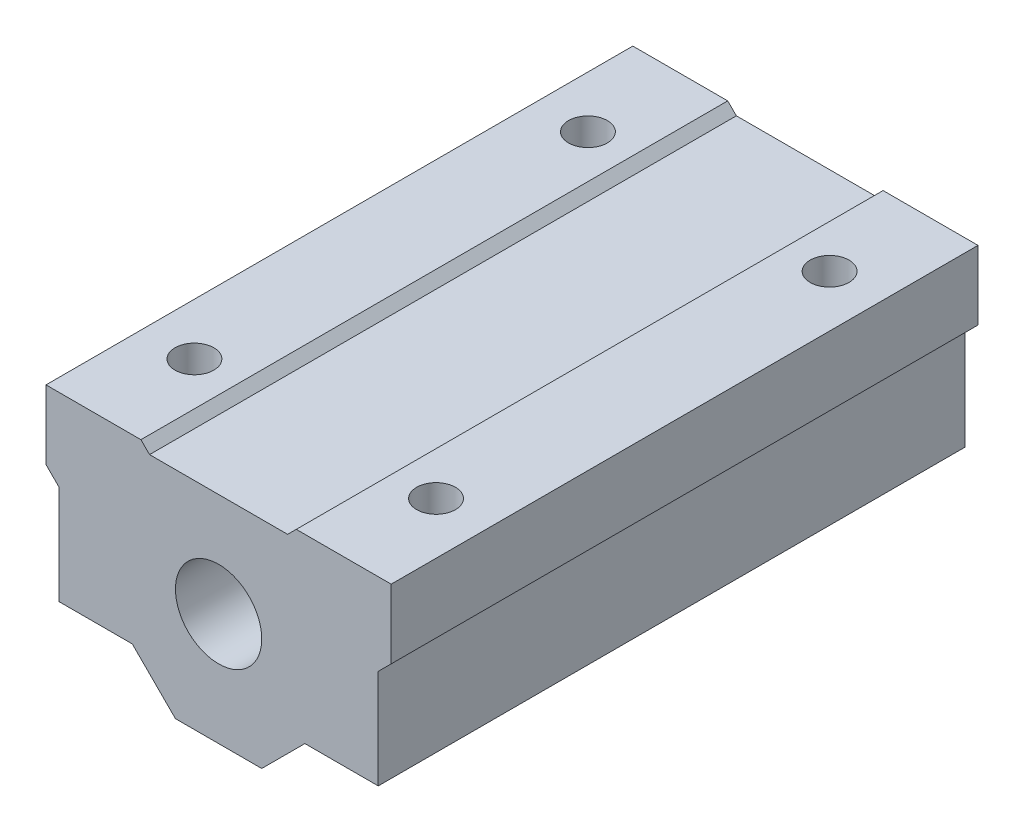
ISO-10303-21;
HEADER;
FILE_DESCRIPTION(('STEP AP214'),'2;1');
FILE_NAME('part.step','',(''),(''),'','','');
FILE_SCHEMA(('AUTOMOTIVE_DESIGN { 1 0 10303 214 1 1 1 1 }'));
ENDSEC;
DATA;
#1=APPLICATION_CONTEXT('core data for automotive mechanical design processes');
#2=APPLICATION_PROTOCOL_DEFINITION('international standard','automotive_design',2000,#1);
#3=PRODUCT_CONTEXT('',#1,'mechanical');
#4=PRODUCT('Part','Part','',(#3));
#5=PRODUCT_RELATED_PRODUCT_CATEGORY('part','',(#4));
#6=PRODUCT_DEFINITION_FORMATION('','',#4);
#7=PRODUCT_DEFINITION_CONTEXT('part definition',#1,'design');
#8=PRODUCT_DEFINITION('design','',#6,#7);
#9=PRODUCT_DEFINITION_SHAPE('','',#8);
#10=(LENGTH_UNIT() NAMED_UNIT(*) SI_UNIT(.MILLI.,.METRE.));
#11=(NAMED_UNIT(*) PLANE_ANGLE_UNIT() SI_UNIT($,.RADIAN.));
#12=(NAMED_UNIT(*) SI_UNIT($,.STERADIAN.) SOLID_ANGLE_UNIT());
#13=UNCERTAINTY_MEASURE_WITH_UNIT(LENGTH_MEASURE(1.E-05),#10,'distance_accuracy_value','');
#14=(GEOMETRIC_REPRESENTATION_CONTEXT(3) GLOBAL_UNCERTAINTY_ASSIGNED_CONTEXT((#13)) GLOBAL_UNIT_ASSIGNED_CONTEXT((#10,
#11,#12)) REPRESENTATION_CONTEXT('',''));
#15=CARTESIAN_POINT('',(0.,0.,0.));
#16=DIRECTION('',(0.,0.,1.));
#17=DIRECTION('',(1.,0.,0.));
#18=AXIS2_PLACEMENT_3D('',#15,#16,#17);
#19=CARTESIAN_POINT('',(0.,0.,68.));
#20=DIRECTION('',(0.,0.,1.));
#21=DIRECTION('',(1.,0.,0.));
#22=AXIS2_PLACEMENT_3D('',#19,#20,#21);
#23=PLANE('',#22);
#24=DIRECTION('',(-1.,0.,0.));
#25=VECTOR('',#24,1.);
#26=CARTESIAN_POINT('',(-20.,13.,68.));
#27=LINE('',#26,#25);
#28=CARTESIAN_POINT('',(-9.,13.,68.));
#29=VERTEX_POINT('',#28);
#30=CARTESIAN_POINT('',(-20.,13.,68.));
#31=VERTEX_POINT('',#30);
#32=EDGE_CURVE('E213',#29,#31,#27,.T.);
#33=ORIENTED_EDGE('',*,*,#32,.T.);
#34=DIRECTION('',(0.,-1.,0.));
#35=VECTOR('',#34,1.);
#36=CARTESIAN_POINT('',(-20.,5.,68.));
#37=LINE('',#36,#35);
#38=CARTESIAN_POINT('',(-20.,5.,68.));
#39=VERTEX_POINT('',#38);
#40=EDGE_CURVE('E121',#31,#39,#37,.T.);
#41=ORIENTED_EDGE('',*,*,#40,.T.);
#42=DIRECTION('',(0.707106781186544,-0.707106781186551,0.));
#43=VECTOR('',#42,1.);
#44=CARTESIAN_POINT('',(-20.,5.,68.));
#45=LINE('',#44,#43);
#46=CARTESIAN_POINT('',(-18.5,3.49999999999998,68.));
#47=VERTEX_POINT('',#46);
#48=EDGE_CURVE('E271',#39,#47,#45,.T.);
#49=ORIENTED_EDGE('',*,*,#48,.T.);
#50=DIRECTION('',(0.,-1.,0.));
#51=VECTOR('',#50,1.);
#52=CARTESIAN_POINT('',(-18.5,3.49999999999998,68.));
#53=LINE('',#52,#51);
#54=CARTESIAN_POINT('',(-18.5,-8.,68.));
#55=VERTEX_POINT('',#54);
#56=EDGE_CURVE('E273',#47,#55,#53,.T.);
#57=ORIENTED_EDGE('',*,*,#56,.T.);
#58=DIRECTION('',(1.,0.,0.));
#59=VECTOR('',#58,1.);
#60=CARTESIAN_POINT('',(-18.5,-8.,68.));
#61=LINE('',#60,#59);
#62=CARTESIAN_POINT('',(-9.99999999999998,-8.,68.));
#63=VERTEX_POINT('',#62);
#64=EDGE_CURVE('E275',#55,#63,#61,.T.);
#65=ORIENTED_EDGE('',*,*,#64,.T.);
#66=DIRECTION('',(0.707106781186546,-0.707106781186549,0.));
#67=VECTOR('',#66,1.);
#68=CARTESIAN_POINT('',(-9.99999999999998,-8.,68.));
#69=LINE('',#68,#67);
#70=CARTESIAN_POINT('',(-5.,-13.,68.));
#71=VERTEX_POINT('',#70);
#72=EDGE_CURVE('E277',#63,#71,#69,.T.);
#73=ORIENTED_EDGE('',*,*,#72,.T.);
#74=DIRECTION('',(1.,0.,0.));
#75=VECTOR('',#74,1.);
#76=CARTESIAN_POINT('',(-5.,-13.,68.));
#77=LINE('',#76,#75);
#78=CARTESIAN_POINT('',(5.,-13.,68.));
#79=VERTEX_POINT('',#78);
#80=EDGE_CURVE('E279',#71,#79,#77,.T.);
#81=ORIENTED_EDGE('',*,*,#80,.T.);
#82=DIRECTION('',(0.707106781186546,0.707106781186549,0.));
#83=VECTOR('',#82,1.);
#84=CARTESIAN_POINT('',(9.99999999999998,-8.,68.));
#85=LINE('',#84,#83);
#86=CARTESIAN_POINT('',(9.99999999999998,-8.,68.));
#87=VERTEX_POINT('',#86);
#88=EDGE_CURVE('E281',#79,#87,#85,.T.);
#89=ORIENTED_EDGE('',*,*,#88,.T.);
#90=DIRECTION('',(1.,0.,0.));
#91=VECTOR('',#90,1.);
#92=CARTESIAN_POINT('',(9.99999999999998,-8.,68.));
#93=LINE('',#92,#91);
#94=CARTESIAN_POINT('',(18.5,-8.,68.));
#95=VERTEX_POINT('',#94);
#96=EDGE_CURVE('E283',#87,#95,#93,.T.);
#97=ORIENTED_EDGE('',*,*,#96,.T.);
#98=DIRECTION('',(0.,1.,0.));
#99=VECTOR('',#98,1.);
#100=CARTESIAN_POINT('',(18.5,3.49999999999998,68.));
#101=LINE('',#100,#99);
#102=CARTESIAN_POINT('',(18.5,3.49999999999998,68.));
#103=VERTEX_POINT('',#102);
#104=EDGE_CURVE('E285',#95,#103,#101,.T.);
#105=ORIENTED_EDGE('',*,*,#104,.T.);
#106=DIRECTION('',(0.707106781186544,0.707106781186551,0.));
#107=VECTOR('',#106,1.);
#108=CARTESIAN_POINT('',(20.,5.,68.));
#109=LINE('',#108,#107);
#110=CARTESIAN_POINT('',(20.,5.,68.));
#111=VERTEX_POINT('',#110);
#112=EDGE_CURVE('E287',#103,#111,#109,.T.);
#113=ORIENTED_EDGE('',*,*,#112,.T.);
#114=DIRECTION('',(0.,1.,0.));
#115=VECTOR('',#114,1.);
#116=CARTESIAN_POINT('',(20.,5.,68.));
#117=LINE('',#116,#115);
#118=CARTESIAN_POINT('',(20.,13.,68.));
#119=VERTEX_POINT('',#118);
#120=EDGE_CURVE('E289',#111,#119,#117,.T.);
#121=ORIENTED_EDGE('',*,*,#120,.T.);
#122=DIRECTION('',(-1.,0.,0.));
#123=VECTOR('',#122,1.);
#124=CARTESIAN_POINT('',(20.,13.,68.));
#125=LINE('',#124,#123);
#126=CARTESIAN_POINT('',(9.,13.,68.));
#127=VERTEX_POINT('',#126);
#128=EDGE_CURVE('E164',#119,#127,#125,.T.);
#129=ORIENTED_EDGE('',*,*,#128,.T.);
#130=DIRECTION('',(-0.707106781186546,-0.707106781186549,0.));
#131=VECTOR('',#130,1.);
#132=CARTESIAN_POINT('',(9.,13.,68.));
#133=LINE('',#132,#131);
#134=CARTESIAN_POINT('',(8.,12.,68.));
#135=VERTEX_POINT('',#134);
#136=EDGE_CURVE('E158',#127,#135,#133,.T.);
#137=ORIENTED_EDGE('',*,*,#136,.T.);
#138=DIRECTION('',(-1.,0.,0.));
#139=VECTOR('',#138,1.);
#140=CARTESIAN_POINT('',(-8.,12.,68.));
#141=LINE('',#140,#139);
#142=CARTESIAN_POINT('',(-8.,12.,68.));
#143=VERTEX_POINT('',#142);
#144=EDGE_CURVE('E162',#135,#143,#141,.T.);
#145=ORIENTED_EDGE('',*,*,#144,.T.);
#146=DIRECTION('',(-0.707106781186546,0.707106781186549,0.));
#147=VECTOR('',#146,1.);
#148=CARTESIAN_POINT('',(-9.,13.,68.));
#149=LINE('',#148,#147);
#150=EDGE_CURVE('E54',#143,#29,#149,.T.);
#151=ORIENTED_EDGE('',*,*,#150,.T.);
#152=EDGE_LOOP('',(#33,#41,#49,#57,#65,#73,#81,#89,#97,#105,#113,#121,#129,#137,#145,#151));
#153=FACE_BOUND('',#152,.T.);
#154=CARTESIAN_POINT('',(0.,0.,68.));
#155=DIRECTION('',(0.,0.,1.));
#156=DIRECTION('',(1.,0.,0.));
#157=AXIS2_PLACEMENT_3D('',#154,#155,#156);
#158=CIRCLE('',#157,5.);
#159=CARTESIAN_POINT('',(5.,0.,68.));
#160=VERTEX_POINT('',#159);
#161=EDGE_CURVE('E186',#160,#160,#158,.T.);
#162=ORIENTED_EDGE('',*,*,#161,.F.);
#163=EDGE_LOOP('',(#162));
#164=FACE_BOUND('',#163,.T.);
#165=ADVANCED_FACE('F35',(#153,#164),#23,.T.);
#166=CARTESIAN_POINT('',(0.,0.,0.));
#167=DIRECTION('',(0.,0.,1.));
#168=DIRECTION('',(1.,0.,0.));
#169=AXIS2_PLACEMENT_3D('',#166,#167,#168);
#170=PLANE('',#169);
#171=DIRECTION('',(-1.,0.,0.));
#172=VECTOR('',#171,1.);
#173=CARTESIAN_POINT('',(-20.,13.,0.));
#174=LINE('',#173,#172);
#175=CARTESIAN_POINT('',(-9.,13.,0.));
#176=VERTEX_POINT('',#175);
#177=CARTESIAN_POINT('',(-20.,13.,0.));
#178=VERTEX_POINT('',#177);
#179=EDGE_CURVE('E182',#176,#178,#174,.T.);
#180=ORIENTED_EDGE('',*,*,#179,.F.);
#181=DIRECTION('',(-0.707106781186546,0.707106781186549,0.));
#182=VECTOR('',#181,1.);
#183=CARTESIAN_POINT('',(-9.,13.,0.));
#184=LINE('',#183,#182);
#185=CARTESIAN_POINT('',(-8.,12.,0.));
#186=VERTEX_POINT('',#185);
#187=EDGE_CURVE('E113',#186,#176,#184,.T.);
#188=ORIENTED_EDGE('',*,*,#187,.F.);
#189=DIRECTION('',(-1.,0.,0.));
#190=VECTOR('',#189,1.);
#191=CARTESIAN_POINT('',(-8.,12.,0.));
#192=LINE('',#191,#190);
#193=CARTESIAN_POINT('',(8.,12.,0.));
#194=VERTEX_POINT('',#193);
#195=EDGE_CURVE('E107',#194,#186,#192,.T.);
#196=ORIENTED_EDGE('',*,*,#195,.F.);
#197=DIRECTION('',(-0.707106781186546,-0.707106781186549,0.));
#198=VECTOR('',#197,1.);
#199=CARTESIAN_POINT('',(9.,13.,0.));
#200=LINE('',#199,#198);
#201=CARTESIAN_POINT('',(9.,13.,0.));
#202=VERTEX_POINT('',#201);
#203=EDGE_CURVE('E172',#202,#194,#200,.T.);
#204=ORIENTED_EDGE('',*,*,#203,.F.);
#205=DIRECTION('',(-1.,0.,0.));
#206=VECTOR('',#205,1.);
#207=CARTESIAN_POINT('',(20.,13.,0.));
#208=LINE('',#207,#206);
#209=CARTESIAN_POINT('',(20.,13.,0.));
#210=VERTEX_POINT('',#209);
#211=EDGE_CURVE('E208',#210,#202,#208,.T.);
#212=ORIENTED_EDGE('',*,*,#211,.F.);
#213=DIRECTION('',(0.,1.,0.));
#214=VECTOR('',#213,1.);
#215=CARTESIAN_POINT('',(20.,5.,0.));
#216=LINE('',#215,#214);
#217=CARTESIAN_POINT('',(20.,5.,0.));
#218=VERTEX_POINT('',#217);
#219=EDGE_CURVE('E206',#218,#210,#216,.T.);
#220=ORIENTED_EDGE('',*,*,#219,.F.);
#221=DIRECTION('',(0.707106781186544,0.707106781186551,0.));
#222=VECTOR('',#221,1.);
#223=CARTESIAN_POINT('',(20.,5.,0.));
#224=LINE('',#223,#222);
#225=CARTESIAN_POINT('',(18.5,3.49999999999998,0.));
#226=VERTEX_POINT('',#225);
#227=EDGE_CURVE('E204',#226,#218,#224,.T.);
#228=ORIENTED_EDGE('',*,*,#227,.F.);
#229=DIRECTION('',(0.,1.,0.));
#230=VECTOR('',#229,1.);
#231=CARTESIAN_POINT('',(18.5,3.49999999999998,0.));
#232=LINE('',#231,#230);
#233=CARTESIAN_POINT('',(18.5,-8.,0.));
#234=VERTEX_POINT('',#233);
#235=EDGE_CURVE('E202',#234,#226,#232,.T.);
#236=ORIENTED_EDGE('',*,*,#235,.F.);
#237=DIRECTION('',(1.,0.,0.));
#238=VECTOR('',#237,1.);
#239=CARTESIAN_POINT('',(9.99999999999998,-8.,0.));
#240=LINE('',#239,#238);
#241=CARTESIAN_POINT('',(9.99999999999998,-8.,0.));
#242=VERTEX_POINT('',#241);
#243=EDGE_CURVE('E200',#242,#234,#240,.T.);
#244=ORIENTED_EDGE('',*,*,#243,.F.);
#245=DIRECTION('',(0.707106781186546,0.707106781186549,0.));
#246=VECTOR('',#245,1.);
#247=CARTESIAN_POINT('',(9.99999999999998,-8.,0.));
#248=LINE('',#247,#246);
#249=CARTESIAN_POINT('',(5.,-13.,0.));
#250=VERTEX_POINT('',#249);
#251=EDGE_CURVE('E198',#250,#242,#248,.T.);
#252=ORIENTED_EDGE('',*,*,#251,.F.);
#253=DIRECTION('',(1.,0.,0.));
#254=VECTOR('',#253,1.);
#255=CARTESIAN_POINT('',(-5.,-13.,0.));
#256=LINE('',#255,#254);
#257=CARTESIAN_POINT('',(-5.,-13.,0.));
#258=VERTEX_POINT('',#257);
#259=EDGE_CURVE('E196',#258,#250,#256,.T.);
#260=ORIENTED_EDGE('',*,*,#259,.F.);
#261=DIRECTION('',(0.707106781186546,-0.707106781186549,0.));
#262=VECTOR('',#261,1.);
#263=CARTESIAN_POINT('',(-9.99999999999998,-8.,0.));
#264=LINE('',#263,#262);
#265=CARTESIAN_POINT('',(-9.99999999999998,-8.,0.));
#266=VERTEX_POINT('',#265);
#267=EDGE_CURVE('E194',#266,#258,#264,.T.);
#268=ORIENTED_EDGE('',*,*,#267,.F.);
#269=DIRECTION('',(1.,0.,0.));
#270=VECTOR('',#269,1.);
#271=CARTESIAN_POINT('',(-18.5,-8.,0.));
#272=LINE('',#271,#270);
#273=CARTESIAN_POINT('',(-18.5,-8.,0.));
#274=VERTEX_POINT('',#273);
#275=EDGE_CURVE('E192',#274,#266,#272,.T.);
#276=ORIENTED_EDGE('',*,*,#275,.F.);
#277=DIRECTION('',(0.,-1.,0.));
#278=VECTOR('',#277,1.);
#279=CARTESIAN_POINT('',(-18.5,3.49999999999998,0.));
#280=LINE('',#279,#278);
#281=CARTESIAN_POINT('',(-18.5,3.49999999999998,0.));
#282=VERTEX_POINT('',#281);
#283=EDGE_CURVE('E190',#282,#274,#280,.T.);
#284=ORIENTED_EDGE('',*,*,#283,.F.);
#285=DIRECTION('',(0.707106781186544,-0.707106781186551,0.));
#286=VECTOR('',#285,1.);
#287=CARTESIAN_POINT('',(-20.,5.,0.));
#288=LINE('',#287,#286);
#289=CARTESIAN_POINT('',(-20.,5.,0.));
#290=VERTEX_POINT('',#289);
#291=EDGE_CURVE('E188',#290,#282,#288,.T.);
#292=ORIENTED_EDGE('',*,*,#291,.F.);
#293=DIRECTION('',(0.,-1.,0.));
#294=VECTOR('',#293,1.);
#295=CARTESIAN_POINT('',(-20.,5.,0.));
#296=LINE('',#295,#294);
#297=EDGE_CURVE('E185',#178,#290,#296,.T.);
#298=ORIENTED_EDGE('',*,*,#297,.F.);
#299=EDGE_LOOP('',(#180,#188,#196,#204,#212,#220,#228,#236,#244,#252,#260,#268,#276,#284,#292,#298));
#300=FACE_BOUND('',#299,.T.);
#301=CARTESIAN_POINT('',(0.,0.,0.));
#302=DIRECTION('',(0.,0.,1.));
#303=DIRECTION('',(1.,0.,0.));
#304=AXIS2_PLACEMENT_3D('',#301,#302,#303);
#305=CIRCLE('',#304,5.);
#306=CARTESIAN_POINT('',(5.,0.,0.));
#307=VERTEX_POINT('',#306);
#308=EDGE_CURVE('E254',#307,#307,#305,.T.);
#309=ORIENTED_EDGE('',*,*,#308,.T.);
#310=EDGE_LOOP('',(#309));
#311=FACE_BOUND('',#310,.T.);
#312=ADVANCED_FACE('F302',(#300,#311),#170,.F.);
#313=CARTESIAN_POINT('',(-20.,13.,68.));
#314=DIRECTION('',(0.,-1.,0.));
#315=DIRECTION('',(0.,0.,-1.));
#316=AXIS2_PLACEMENT_3D('',#313,#314,#315);
#317=PLANE('',#316);
#318=CARTESIAN_POINT('',(-14.,13.,11.2));
#319=DIRECTION('',(0.,1.,0.));
#320=DIRECTION('',(0.,0.,1.));
#321=AXIS2_PLACEMENT_3D('',#318,#319,#320);
#322=CIRCLE('',#321,2.25);
#323=CARTESIAN_POINT('',(-14.,13.,13.45));
#324=VERTEX_POINT('',#323);
#325=EDGE_CURVE('E351',#324,#324,#322,.T.);
#326=ORIENTED_EDGE('',*,*,#325,.F.);
#327=EDGE_LOOP('',(#326));
#328=FACE_BOUND('',#327,.T.);
#329=CARTESIAN_POINT('',(-14.,13.,56.8));
#330=DIRECTION('',(0.,1.,0.));
#331=DIRECTION('',(0.,0.,1.));
#332=AXIS2_PLACEMENT_3D('',#329,#330,#331);
#333=CIRCLE('',#332,2.25);
#334=CARTESIAN_POINT('',(-14.,13.,59.05));
#335=VERTEX_POINT('',#334);
#336=EDGE_CURVE('E346',#335,#335,#333,.T.);
#337=ORIENTED_EDGE('',*,*,#336,.F.);
#338=EDGE_LOOP('',(#337));
#339=FACE_BOUND('',#338,.T.);
#340=ORIENTED_EDGE('',*,*,#179,.T.);
#341=DIRECTION('',(0.,0.,-1.));
#342=VECTOR('',#341,1.);
#343=CARTESIAN_POINT('',(-20.,13.,68.));
#344=LINE('',#343,#342);
#345=EDGE_CURVE('E11',#31,#178,#344,.T.);
#346=ORIENTED_EDGE('',*,*,#345,.F.);
#347=ORIENTED_EDGE('',*,*,#32,.F.);
#348=DIRECTION('',(0.,0.,-1.));
#349=VECTOR('',#348,1.);
#350=CARTESIAN_POINT('',(-9.,13.,68.));
#351=LINE('',#350,#349);
#352=EDGE_CURVE('E178',#29,#176,#351,.T.);
#353=ORIENTED_EDGE('',*,*,#352,.T.);
#354=EDGE_LOOP('',(#340,#346,#347,#353));
#355=FACE_BOUND('',#354,.T.);
#356=ADVANCED_FACE('F37',(#328,#339,#355),#317,.F.);
#357=CARTESIAN_POINT('',(-20.,5.,68.));
#358=DIRECTION('',(1.,0.,0.));
#359=DIRECTION('',(0.,0.,-1.));
#360=AXIS2_PLACEMENT_3D('',#357,#358,#359);
#361=PLANE('',#360);
#362=ORIENTED_EDGE('',*,*,#297,.T.);
#363=DIRECTION('',(0.,0.,-1.));
#364=VECTOR('',#363,1.);
#365=CARTESIAN_POINT('',(-20.,5.,68.));
#366=LINE('',#365,#364);
#367=EDGE_CURVE('E45',#39,#290,#366,.T.);
#368=ORIENTED_EDGE('',*,*,#367,.F.);
#369=ORIENTED_EDGE('',*,*,#40,.F.);
#370=ORIENTED_EDGE('',*,*,#345,.T.);
#371=EDGE_LOOP('',(#362,#368,#369,#370));
#372=FACE_BOUND('',#371,.T.);
#373=ADVANCED_FACE('F403',(#372),#361,.F.);
#374=CARTESIAN_POINT('',(-20.,5.,68.));
#375=DIRECTION('',(0.707106781186551,0.707106781186544,0.));
#376=DIRECTION('',(-0.707106781186544,0.707106781186551,0.));
#377=AXIS2_PLACEMENT_3D('',#374,#375,#376);
#378=PLANE('',#377);
#379=ORIENTED_EDGE('',*,*,#291,.T.);
#380=DIRECTION('',(0.,0.,-1.));
#381=VECTOR('',#380,1.);
#382=CARTESIAN_POINT('',(-18.5,3.49999999999998,68.));
#383=LINE('',#382,#381);
#384=EDGE_CURVE('E244',#47,#282,#383,.T.);
#385=ORIENTED_EDGE('',*,*,#384,.F.);
#386=ORIENTED_EDGE('',*,*,#48,.F.);
#387=ORIENTED_EDGE('',*,*,#367,.T.);
#388=EDGE_LOOP('',(#379,#385,#386,#387));
#389=FACE_BOUND('',#388,.T.);
#390=ADVANCED_FACE('F400',(#389),#378,.F.);
#391=CARTESIAN_POINT('',(-18.5,3.49999999999998,68.));
#392=DIRECTION('',(1.,0.,0.));
#393=DIRECTION('',(0.,0.,-1.));
#394=AXIS2_PLACEMENT_3D('',#391,#392,#393);
#395=PLANE('',#394);
#396=ORIENTED_EDGE('',*,*,#283,.T.);
#397=DIRECTION('',(0.,0.,-1.));
#398=VECTOR('',#397,1.);
#399=CARTESIAN_POINT('',(-18.5,-8.,68.));
#400=LINE('',#399,#398);
#401=EDGE_CURVE('E241',#55,#274,#400,.T.);
#402=ORIENTED_EDGE('',*,*,#401,.F.);
#403=ORIENTED_EDGE('',*,*,#56,.F.);
#404=ORIENTED_EDGE('',*,*,#384,.T.);
#405=EDGE_LOOP('',(#396,#402,#403,#404));
#406=FACE_BOUND('',#405,.T.);
#407=ADVANCED_FACE('F396',(#406),#395,.F.);
#408=CARTESIAN_POINT('',(-18.5,-8.,68.));
#409=DIRECTION('',(0.,1.,0.));
#410=DIRECTION('',(0.,0.,1.));
#411=AXIS2_PLACEMENT_3D('',#408,#409,#410);
#412=PLANE('',#411);
#413=CARTESIAN_POINT('',(-14.,-8.,11.2));
#414=DIRECTION('',(0.,1.,0.));
#415=DIRECTION('',(0.,0.,1.));
#416=AXIS2_PLACEMENT_3D('',#413,#414,#415);
#417=CIRCLE('',#416,2.25);
#418=CARTESIAN_POINT('',(-14.,-8.,13.45));
#419=VERTEX_POINT('',#418);
#420=EDGE_CURVE('E39',#419,#419,#417,.T.);
#421=ORIENTED_EDGE('',*,*,#420,.T.);
#422=EDGE_LOOP('',(#421));
#423=FACE_BOUND('',#422,.T.);
#424=CARTESIAN_POINT('',(-14.,-8.,56.8));
#425=DIRECTION('',(0.,1.,0.));
#426=DIRECTION('',(0.,0.,1.));
#427=AXIS2_PLACEMENT_3D('',#424,#425,#426);
#428=CIRCLE('',#427,2.25);
#429=CARTESIAN_POINT('',(-14.,-8.,59.05));
#430=VERTEX_POINT('',#429);
#431=EDGE_CURVE('E248',#430,#430,#428,.T.);
#432=ORIENTED_EDGE('',*,*,#431,.T.);
#433=EDGE_LOOP('',(#432));
#434=FACE_BOUND('',#433,.T.);
#435=ORIENTED_EDGE('',*,*,#275,.T.);
#436=DIRECTION('',(0.,0.,-1.));
#437=VECTOR('',#436,1.);
#438=CARTESIAN_POINT('',(-9.99999999999998,-8.,68.));
#439=LINE('',#438,#437);
#440=EDGE_CURVE('E238',#63,#266,#439,.T.);
#441=ORIENTED_EDGE('',*,*,#440,.F.);
#442=ORIENTED_EDGE('',*,*,#64,.F.);
#443=ORIENTED_EDGE('',*,*,#401,.T.);
#444=EDGE_LOOP('',(#435,#441,#442,#443));
#445=FACE_BOUND('',#444,.T.);
#446=ADVANCED_FACE('F392',(#423,#434,#445),#412,.F.);
#447=CARTESIAN_POINT('',(-9.99999999999998,-8.,68.));
#448=DIRECTION('',(0.707106781186549,0.707106781186546,0.));
#449=DIRECTION('',(-0.707106781186546,0.707106781186549,0.));
#450=AXIS2_PLACEMENT_3D('',#447,#448,#449);
#451=PLANE('',#450);
#452=ORIENTED_EDGE('',*,*,#267,.T.);
#453=DIRECTION('',(0.,0.,-1.));
#454=VECTOR('',#453,1.);
#455=CARTESIAN_POINT('',(-5.,-13.,68.));
#456=LINE('',#455,#454);
#457=EDGE_CURVE('E235',#71,#258,#456,.T.);
#458=ORIENTED_EDGE('',*,*,#457,.F.);
#459=ORIENTED_EDGE('',*,*,#72,.F.);
#460=ORIENTED_EDGE('',*,*,#440,.T.);
#461=EDGE_LOOP('',(#452,#458,#459,#460));
#462=FACE_BOUND('',#461,.T.);
#463=ADVANCED_FACE('F388',(#462),#451,.F.);
#464=CARTESIAN_POINT('',(-5.,-13.,68.));
#465=DIRECTION('',(0.,1.,0.));
#466=DIRECTION('',(0.,0.,1.));
#467=AXIS2_PLACEMENT_3D('',#464,#465,#466);
#468=PLANE('',#467);
#469=ORIENTED_EDGE('',*,*,#259,.T.);
#470=DIRECTION('',(0.,0.,-1.));
#471=VECTOR('',#470,1.);
#472=CARTESIAN_POINT('',(5.,-13.,68.));
#473=LINE('',#472,#471);
#474=EDGE_CURVE('E232',#79,#250,#473,.T.);
#475=ORIENTED_EDGE('',*,*,#474,.F.);
#476=ORIENTED_EDGE('',*,*,#80,.F.);
#477=ORIENTED_EDGE('',*,*,#457,.T.);
#478=EDGE_LOOP('',(#469,#475,#476,#477));
#479=FACE_BOUND('',#478,.T.);
#480=ADVANCED_FACE('F384',(#479),#468,.F.);
#481=CARTESIAN_POINT('',(9.99999999999998,-8.,68.));
#482=DIRECTION('',(-0.707106781186549,0.707106781186546,0.));
#483=DIRECTION('',(-0.707106781186546,-0.707106781186549,0.));
#484=AXIS2_PLACEMENT_3D('',#481,#482,#483);
#485=PLANE('',#484);
#486=ORIENTED_EDGE('',*,*,#251,.T.);
#487=DIRECTION('',(0.,0.,-1.));
#488=VECTOR('',#487,1.);
#489=CARTESIAN_POINT('',(9.99999999999998,-8.,68.));
#490=LINE('',#489,#488);
#491=EDGE_CURVE('E229',#87,#242,#490,.T.);
#492=ORIENTED_EDGE('',*,*,#491,.F.);
#493=ORIENTED_EDGE('',*,*,#88,.F.);
#494=ORIENTED_EDGE('',*,*,#474,.T.);
#495=EDGE_LOOP('',(#486,#492,#493,#494));
#496=FACE_BOUND('',#495,.T.);
#497=ADVANCED_FACE('F381',(#496),#485,.F.);
#498=CARTESIAN_POINT('',(9.99999999999998,-8.,68.));
#499=DIRECTION('',(0.,1.,0.));
#500=DIRECTION('',(0.,0.,1.));
#501=AXIS2_PLACEMENT_3D('',#498,#499,#500);
#502=PLANE('',#501);
#503=CARTESIAN_POINT('',(14.,-8.,56.8));
#504=DIRECTION('',(0.,1.,0.));
#505=DIRECTION('',(0.,0.,1.));
#506=AXIS2_PLACEMENT_3D('',#503,#504,#505);
#507=CIRCLE('',#506,2.25);
#508=CARTESIAN_POINT('',(14.,-8.,59.05));
#509=VERTEX_POINT('',#508);
#510=EDGE_CURVE('E250',#509,#509,#507,.T.);
#511=ORIENTED_EDGE('',*,*,#510,.T.);
#512=EDGE_LOOP('',(#511));
#513=FACE_BOUND('',#512,.T.);
#514=CARTESIAN_POINT('',(14.,-8.,11.2));
#515=DIRECTION('',(0.,1.,0.));
#516=DIRECTION('',(0.,0.,1.));
#517=AXIS2_PLACEMENT_3D('',#514,#515,#516);
#518=CIRCLE('',#517,2.25);
#519=CARTESIAN_POINT('',(14.,-8.,13.45));
#520=VERTEX_POINT('',#519);
#521=EDGE_CURVE('E256',#520,#520,#518,.T.);
#522=ORIENTED_EDGE('',*,*,#521,.T.);
#523=EDGE_LOOP('',(#522));
#524=FACE_BOUND('',#523,.T.);
#525=ORIENTED_EDGE('',*,*,#243,.T.);
#526=DIRECTION('',(0.,0.,-1.));
#527=VECTOR('',#526,1.);
#528=CARTESIAN_POINT('',(18.5,-8.,68.));
#529=LINE('',#528,#527);
#530=EDGE_CURVE('E226',#95,#234,#529,.T.);
#531=ORIENTED_EDGE('',*,*,#530,.F.);
#532=ORIENTED_EDGE('',*,*,#96,.F.);
#533=ORIENTED_EDGE('',*,*,#491,.T.);
#534=EDGE_LOOP('',(#525,#531,#532,#533));
#535=FACE_BOUND('',#534,.T.);
#536=ADVANCED_FACE('F377',(#513,#524,#535),#502,.F.);
#537=CARTESIAN_POINT('',(18.5,3.49999999999998,68.));
#538=DIRECTION('',(-1.,0.,0.));
#539=DIRECTION('',(0.,0.,1.));
#540=AXIS2_PLACEMENT_3D('',#537,#538,#539);
#541=PLANE('',#540);
#542=ORIENTED_EDGE('',*,*,#235,.T.);
#543=DIRECTION('',(0.,0.,-1.));
#544=VECTOR('',#543,1.);
#545=CARTESIAN_POINT('',(18.5,3.49999999999998,68.));
#546=LINE('',#545,#544);
#547=EDGE_CURVE('E223',#103,#226,#546,.T.);
#548=ORIENTED_EDGE('',*,*,#547,.F.);
#549=ORIENTED_EDGE('',*,*,#104,.F.);
#550=ORIENTED_EDGE('',*,*,#530,.T.);
#551=EDGE_LOOP('',(#542,#548,#549,#550));
#552=FACE_BOUND('',#551,.T.);
#553=ADVANCED_FACE('F373',(#552),#541,.F.);
#554=CARTESIAN_POINT('',(20.,5.,68.));
#555=DIRECTION('',(-0.707106781186551,0.707106781186544,0.));
#556=DIRECTION('',(-0.707106781186544,-0.707106781186551,0.));
#557=AXIS2_PLACEMENT_3D('',#554,#555,#556);
#558=PLANE('',#557);
#559=ORIENTED_EDGE('',*,*,#227,.T.);
#560=DIRECTION('',(0.,0.,-1.));
#561=VECTOR('',#560,1.);
#562=CARTESIAN_POINT('',(20.,5.,68.));
#563=LINE('',#562,#561);
#564=EDGE_CURVE('E220',#111,#218,#563,.T.);
#565=ORIENTED_EDGE('',*,*,#564,.F.);
#566=ORIENTED_EDGE('',*,*,#112,.F.);
#567=ORIENTED_EDGE('',*,*,#547,.T.);
#568=EDGE_LOOP('',(#559,#565,#566,#567));
#569=FACE_BOUND('',#568,.T.);
#570=ADVANCED_FACE('F367',(#569),#558,.F.);
#571=CARTESIAN_POINT('',(20.,5.,68.));
#572=DIRECTION('',(-1.,0.,0.));
#573=DIRECTION('',(0.,0.,1.));
#574=AXIS2_PLACEMENT_3D('',#571,#572,#573);
#575=PLANE('',#574);
#576=ORIENTED_EDGE('',*,*,#219,.T.);
#577=DIRECTION('',(0.,0.,-1.));
#578=VECTOR('',#577,1.);
#579=CARTESIAN_POINT('',(20.,13.,68.));
#580=LINE('',#579,#578);
#581=EDGE_CURVE('E217',#119,#210,#580,.T.);
#582=ORIENTED_EDGE('',*,*,#581,.F.);
#583=ORIENTED_EDGE('',*,*,#120,.F.);
#584=ORIENTED_EDGE('',*,*,#564,.T.);
#585=EDGE_LOOP('',(#576,#582,#583,#584));
#586=FACE_BOUND('',#585,.T.);
#587=ADVANCED_FACE('F295',(#586),#575,.F.);
#588=CARTESIAN_POINT('',(20.,13.,68.));
#589=DIRECTION('',(0.,-1.,0.));
#590=DIRECTION('',(0.,0.,-1.));
#591=AXIS2_PLACEMENT_3D('',#588,#589,#590);
#592=PLANE('',#591);
#593=CARTESIAN_POINT('',(14.,13.,56.8));
#594=DIRECTION('',(0.,1.,0.));
#595=DIRECTION('',(0.,0.,1.));
#596=AXIS2_PLACEMENT_3D('',#593,#594,#595);
#597=CIRCLE('',#596,2.25);
#598=CARTESIAN_POINT('',(14.,13.,59.05));
#599=VERTEX_POINT('',#598);
#600=EDGE_CURVE('E348',#599,#599,#597,.T.);
#601=ORIENTED_EDGE('',*,*,#600,.F.);
#602=EDGE_LOOP('',(#601));
#603=FACE_BOUND('',#602,.T.);
#604=CARTESIAN_POINT('',(14.,13.,11.2));
#605=DIRECTION('',(0.,1.,0.));
#606=DIRECTION('',(0.,0.,1.));
#607=AXIS2_PLACEMENT_3D('',#604,#605,#606);
#608=CIRCLE('',#607,2.25);
#609=CARTESIAN_POINT('',(14.,13.,13.45));
#610=VERTEX_POINT('',#609);
#611=EDGE_CURVE('E261',#610,#610,#608,.T.);
#612=ORIENTED_EDGE('',*,*,#611,.F.);
#613=EDGE_LOOP('',(#612));
#614=FACE_BOUND('',#613,.T.);
#615=ORIENTED_EDGE('',*,*,#211,.T.);
#616=DIRECTION('',(0.,0.,-1.));
#617=VECTOR('',#616,1.);
#618=CARTESIAN_POINT('',(9.,13.,68.));
#619=LINE('',#618,#617);
#620=EDGE_CURVE('E173',#127,#202,#619,.T.);
#621=ORIENTED_EDGE('',*,*,#620,.F.);
#622=ORIENTED_EDGE('',*,*,#128,.F.);
#623=ORIENTED_EDGE('',*,*,#581,.T.);
#624=EDGE_LOOP('',(#615,#621,#622,#623));
#625=FACE_BOUND('',#624,.T.);
#626=ADVANCED_FACE('F299',(#603,#614,#625),#592,.F.);
#627=CARTESIAN_POINT('',(9.,13.,68.));
#628=DIRECTION('',(0.707106781186549,-0.707106781186546,0.));
#629=DIRECTION('',(0.707106781186546,0.707106781186549,0.));
#630=AXIS2_PLACEMENT_3D('',#627,#628,#629);
#631=PLANE('',#630);
#632=ORIENTED_EDGE('',*,*,#203,.T.);
#633=DIRECTION('',(0.,0.,-1.));
#634=VECTOR('',#633,1.);
#635=CARTESIAN_POINT('',(8.,12.,68.));
#636=LINE('',#635,#634);
#637=EDGE_CURVE('E169',#135,#194,#636,.T.);
#638=ORIENTED_EDGE('',*,*,#637,.F.);
#639=ORIENTED_EDGE('',*,*,#136,.F.);
#640=ORIENTED_EDGE('',*,*,#620,.T.);
#641=EDGE_LOOP('',(#632,#638,#639,#640));
#642=FACE_BOUND('',#641,.T.);
#643=ADVANCED_FACE('F170',(#642),#631,.F.);
#644=CARTESIAN_POINT('',(-8.,12.,68.));
#645=DIRECTION('',(0.,-1.,0.));
#646=DIRECTION('',(0.,0.,-1.));
#647=AXIS2_PLACEMENT_3D('',#644,#645,#646);
#648=PLANE('',#647);
#649=ORIENTED_EDGE('',*,*,#195,.T.);
#650=DIRECTION('',(0.,0.,-1.));
#651=VECTOR('',#650,1.);
#652=CARTESIAN_POINT('',(-8.,12.,68.));
#653=LINE('',#652,#651);
#654=EDGE_CURVE('E174',#143,#186,#653,.T.);
#655=ORIENTED_EDGE('',*,*,#654,.F.);
#656=ORIENTED_EDGE('',*,*,#144,.F.);
#657=ORIENTED_EDGE('',*,*,#637,.T.);
#658=EDGE_LOOP('',(#649,#655,#656,#657));
#659=FACE_BOUND('',#658,.T.);
#660=ADVANCED_FACE('F176',(#659),#648,.F.);
#661=CARTESIAN_POINT('',(-9.,13.,68.));
#662=DIRECTION('',(-0.707106781186549,-0.707106781186546,0.));
#663=DIRECTION('',(0.707106781186546,-0.707106781186549,0.));
#664=AXIS2_PLACEMENT_3D('',#661,#662,#663);
#665=PLANE('',#664);
#666=ORIENTED_EDGE('',*,*,#187,.T.);
#667=ORIENTED_EDGE('',*,*,#352,.F.);
#668=ORIENTED_EDGE('',*,*,#150,.F.);
#669=ORIENTED_EDGE('',*,*,#654,.T.);
#670=EDGE_LOOP('',(#666,#667,#668,#669));
#671=FACE_BOUND('',#670,.T.);
#672=ADVANCED_FACE('F308',(#671),#665,.F.);
#673=CARTESIAN_POINT('',(0.,0.,68.));
#674=DIRECTION('',(0.,0.,-1.));
#675=DIRECTION('',(-1.,0.,0.));
#676=AXIS2_PLACEMENT_3D('',#673,#674,#675);
#677=CYLINDRICAL_SURFACE('',#676,5.);
#678=ORIENTED_EDGE('',*,*,#161,.T.);
#679=EDGE_LOOP('',(#678));
#680=FACE_BOUND('',#679,.T.);
#681=ORIENTED_EDGE('',*,*,#308,.F.);
#682=EDGE_LOOP('',(#681));
#683=FACE_BOUND('',#682,.T.);
#684=ADVANCED_FACE('F310',(#680,#683),#677,.F.);
#685=CARTESIAN_POINT('',(14.,-55.,11.2));
#686=DIRECTION('',(0.,1.,0.));
#687=DIRECTION('',(0.,0.,1.));
#688=AXIS2_PLACEMENT_3D('',#685,#686,#687);
#689=CYLINDRICAL_SURFACE('',#688,2.25);
#690=ORIENTED_EDGE('',*,*,#611,.T.);
#691=EDGE_LOOP('',(#690));
#692=FACE_BOUND('',#691,.T.);
#693=ORIENTED_EDGE('',*,*,#521,.F.);
#694=EDGE_LOOP('',(#693));
#695=FACE_BOUND('',#694,.T.);
#696=ADVANCED_FACE('F316',(#692,#695),#689,.F.);
#697=CARTESIAN_POINT('',(14.,-55.,56.8));
#698=DIRECTION('',(0.,1.,0.));
#699=DIRECTION('',(0.,0.,1.));
#700=AXIS2_PLACEMENT_3D('',#697,#698,#699);
#701=CYLINDRICAL_SURFACE('',#700,2.25);
#702=ORIENTED_EDGE('',*,*,#600,.T.);
#703=EDGE_LOOP('',(#702));
#704=FACE_BOUND('',#703,.T.);
#705=ORIENTED_EDGE('',*,*,#510,.F.);
#706=EDGE_LOOP('',(#705));
#707=FACE_BOUND('',#706,.T.);
#708=ADVANCED_FACE('F329',(#704,#707),#701,.F.);
#709=CARTESIAN_POINT('',(-14.,-55.,56.8));
#710=DIRECTION('',(0.,1.,0.));
#711=DIRECTION('',(0.,0.,1.));
#712=AXIS2_PLACEMENT_3D('',#709,#710,#711);
#713=CYLINDRICAL_SURFACE('',#712,2.25);
#714=ORIENTED_EDGE('',*,*,#336,.T.);
#715=EDGE_LOOP('',(#714));
#716=FACE_BOUND('',#715,.T.);
#717=ORIENTED_EDGE('',*,*,#431,.F.);
#718=EDGE_LOOP('',(#717));
#719=FACE_BOUND('',#718,.T.);
#720=ADVANCED_FACE('F333',(#716,#719),#713,.F.);
#721=CARTESIAN_POINT('',(-14.,-55.,11.2));
#722=DIRECTION('',(0.,1.,0.));
#723=DIRECTION('',(0.,0.,1.));
#724=AXIS2_PLACEMENT_3D('',#721,#722,#723);
#725=CYLINDRICAL_SURFACE('',#724,2.25);
#726=ORIENTED_EDGE('',*,*,#325,.T.);
#727=EDGE_LOOP('',(#726));
#728=FACE_BOUND('',#727,.T.);
#729=ORIENTED_EDGE('',*,*,#420,.F.);
#730=EDGE_LOOP('',(#729));
#731=FACE_BOUND('',#730,.T.);
#732=ADVANCED_FACE('F335',(#728,#731),#725,.F.);
#733=CLOSED_SHELL('',(#165,#312,#356,#373,#390,#407,#446,#463,#480,#497,#536,#553,#570,#587,
#626,#643,#660,#672,#684,#696,#708,#720,#732));
#734=MANIFOLD_SOLID_BREP('B2',#733);
#735=ADVANCED_BREP_SHAPE_REPRESENTATION('',(#18,#734),#14);
#736=SHAPE_DEFINITION_REPRESENTATION(#9,#735);
ENDSEC;
END-ISO-10303-21;
